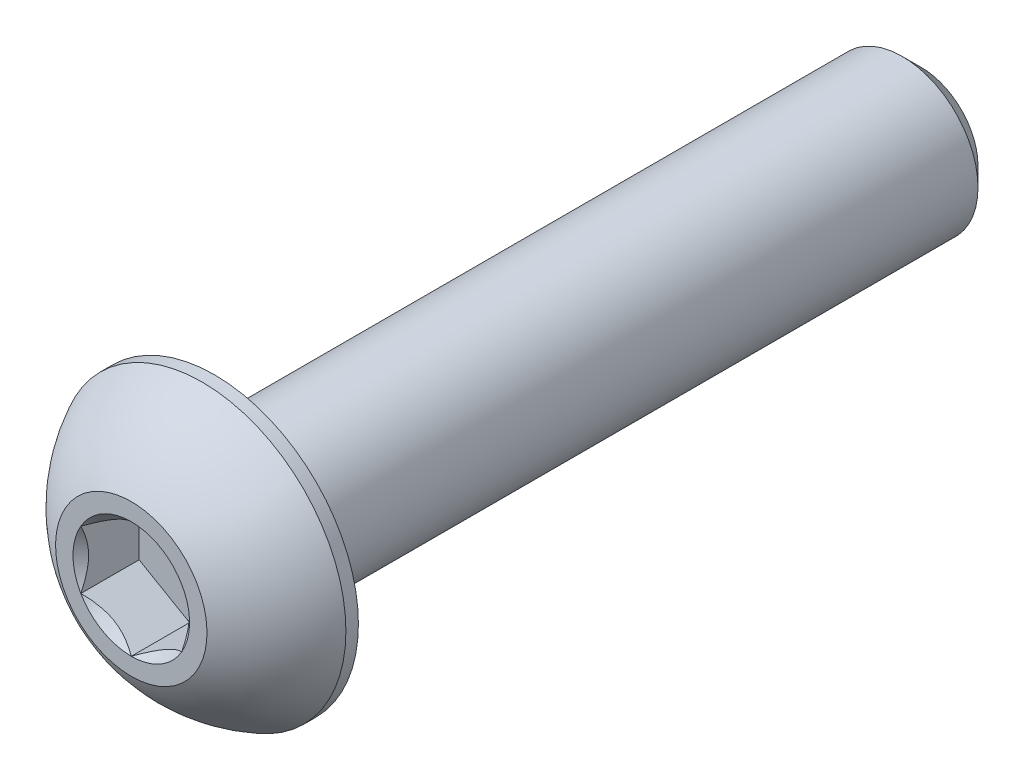
ISO-10303-21;
HEADER;
FILE_DESCRIPTION(('STEP AP214'),'2;1');
FILE_NAME('part.step','',(''),(''),'','','');
FILE_SCHEMA(('AUTOMOTIVE_DESIGN { 1 0 10303 214 1 1 1 1 }'));
ENDSEC;
DATA;
#1=APPLICATION_CONTEXT('core data for automotive mechanical design processes');
#2=APPLICATION_PROTOCOL_DEFINITION('international standard','automotive_design',2000,#1);
#3=PRODUCT_CONTEXT('',#1,'mechanical');
#4=PRODUCT('Part','Part','',(#3));
#5=PRODUCT_RELATED_PRODUCT_CATEGORY('part','',(#4));
#6=PRODUCT_DEFINITION_FORMATION('','',#4);
#7=PRODUCT_DEFINITION_CONTEXT('part definition',#1,'design');
#8=PRODUCT_DEFINITION('design','',#6,#7);
#9=PRODUCT_DEFINITION_SHAPE('','',#8);
#10=(LENGTH_UNIT() NAMED_UNIT(*) SI_UNIT(.MILLI.,.METRE.));
#11=(NAMED_UNIT(*) PLANE_ANGLE_UNIT() SI_UNIT($,.RADIAN.));
#12=(NAMED_UNIT(*) SI_UNIT($,.STERADIAN.) SOLID_ANGLE_UNIT());
#13=UNCERTAINTY_MEASURE_WITH_UNIT(LENGTH_MEASURE(1.E-05),#10,'distance_accuracy_value','');
#14=(GEOMETRIC_REPRESENTATION_CONTEXT(3) GLOBAL_UNCERTAINTY_ASSIGNED_CONTEXT((#13)) GLOBAL_UNIT_ASSIGNED_CONTEXT((#10,
#11,#12)) REPRESENTATION_CONTEXT('',''));
#15=CARTESIAN_POINT('',(0.,0.,0.));
#16=DIRECTION('',(0.,0.,1.));
#17=DIRECTION('',(1.,0.,0.));
#18=AXIS2_PLACEMENT_3D('',#15,#16,#17);
#19=CARTESIAN_POINT('',(0.,0.,-15.65));
#20=DIRECTION('',(0.,0.,1.));
#21=DIRECTION('',(1.,0.,0.));
#22=AXIS2_PLACEMENT_3D('',#19,#20,#21);
#23=PLANE('',#22);
#24=CARTESIAN_POINT('',(0.,0.,-15.65));
#25=DIRECTION('',(0.,0.,1.));
#26=DIRECTION('',(1.,0.,0.));
#27=AXIS2_PLACEMENT_3D('',#24,#25,#26);
#28=CIRCLE('',#27,1.12500000000003);
#29=CARTESIAN_POINT('',(1.12500000000003,0.,-15.65));
#30=VERTEX_POINT('',#29);
#31=EDGE_CURVE('E51',#30,#30,#28,.T.);
#32=ORIENTED_EDGE('',*,*,#31,.F.);
#33=EDGE_LOOP('',(#32));
#34=FACE_BOUND('',#33,.T.);
#35=ADVANCED_FACE('F38',(#34),#23,.F.);
#36=CARTESIAN_POINT('',(0.,0.,-15.65));
#37=DIRECTION('',(0.,0.,1.));
#38=DIRECTION('',(1.,0.,0.));
#39=AXIS2_PLACEMENT_3D('',#36,#37,#38);
#40=CONICAL_SURFACE('',#39,1.12500000000003,0.785398163397429);
#41=CARTESIAN_POINT('',(0.,0.,-15.275));
#42=DIRECTION('',(0.,0.,1.));
#43=DIRECTION('',(1.,0.,0.));
#44=AXIS2_PLACEMENT_3D('',#41,#42,#43);
#45=CIRCLE('',#44,1.50000000000002);
#46=CARTESIAN_POINT('',(1.50000000000002,0.,-15.275));
#47=VERTEX_POINT('',#46);
#48=EDGE_CURVE('E177',#47,#47,#45,.T.);
#49=ORIENTED_EDGE('',*,*,#48,.F.);
#50=EDGE_LOOP('',(#49));
#51=FACE_BOUND('',#50,.T.);
#52=ORIENTED_EDGE('',*,*,#31,.T.);
#53=EDGE_LOOP('',(#52));
#54=FACE_BOUND('',#53,.T.);
#55=ADVANCED_FACE('F182',(#51,#54),#40,.T.);
#56=CARTESIAN_POINT('',(0.,0.,0.));
#57=DIRECTION('',(0.,0.,1.));
#58=DIRECTION('',(1.,0.,0.));
#59=AXIS2_PLACEMENT_3D('',#56,#57,#58);
#60=CYLINDRICAL_SURFACE('',#59,1.50000000000002);
#61=CARTESIAN_POINT('',(0.,0.,-1.65));
#62=DIRECTION('',(0.,0.,1.));
#63=DIRECTION('',(1.,0.,0.));
#64=AXIS2_PLACEMENT_3D('',#61,#62,#63);
#65=CIRCLE('',#64,1.50000000000002);
#66=CARTESIAN_POINT('',(1.50000000000002,0.,-1.65));
#67=VERTEX_POINT('',#66);
#68=EDGE_CURVE('E174',#67,#67,#65,.T.);
#69=ORIENTED_EDGE('',*,*,#68,.F.);
#70=EDGE_LOOP('',(#69));
#71=FACE_BOUND('',#70,.T.);
#72=ORIENTED_EDGE('',*,*,#48,.T.);
#73=EDGE_LOOP('',(#72));
#74=FACE_BOUND('',#73,.T.);
#75=ADVANCED_FACE('F188',(#71,#74),#60,.T.);
#76=CARTESIAN_POINT('',(0.,-2.85,-1.65));
#77=DIRECTION('',(0.,0.,1.));
#78=DIRECTION('',(1.,0.,0.));
#79=AXIS2_PLACEMENT_3D('',#76,#77,#78);
#80=PLANE('',#79);
#81=CARTESIAN_POINT('',(0.,0.,-1.65));
#82=DIRECTION('',(0.,0.,1.));
#83=DIRECTION('',(1.,0.,0.));
#84=AXIS2_PLACEMENT_3D('',#81,#82,#83);
#85=CIRCLE('',#84,2.85);
#86=CARTESIAN_POINT('',(2.85,0.,-1.65));
#87=VERTEX_POINT('',#86);
#88=EDGE_CURVE('E168',#87,#87,#85,.T.);
#89=ORIENTED_EDGE('',*,*,#88,.F.);
#90=EDGE_LOOP('',(#89));
#91=FACE_BOUND('',#90,.T.);
#92=ORIENTED_EDGE('',*,*,#68,.T.);
#93=EDGE_LOOP('',(#92));
#94=FACE_BOUND('',#93,.T.);
#95=ADVANCED_FACE('F193',(#91,#94),#80,.F.);
#96=CARTESIAN_POINT('',(0.,0.,-2.79483288770053));
#97=DIRECTION('',(0.,0.,1.));
#98=DIRECTION('',(0.,-1.,0.));
#99=AXIS2_PLACEMENT_3D('',#96,#97,#98);
#100=SPHERICAL_SURFACE('',#99,3.17192226735975);
#101=CARTESIAN_POINT('',(0.,0.,0.));
#102=DIRECTION('',(0.,0.,1.));
#103=DIRECTION('',(1.,0.,0.));
#104=AXIS2_PLACEMENT_3D('',#101,#102,#103);
#105=CIRCLE('',#104,1.50000000000002);
#106=CARTESIAN_POINT('',(0.,-1.50000000000002,0.));
#107=VERTEX_POINT('',#106);
#108=EDGE_CURVE('E171',#107,#107,#105,.T.);
#109=CARTESIAN_POINT('',(0.,0.,-1.4025));
#110=DIRECTION('',(0.,0.,1.));
#111=DIRECTION('',(1.,0.,0.));
#112=AXIS2_PLACEMENT_3D('',#109,#110,#111);
#113=CIRCLE('',#112,2.85);
#114=CARTESIAN_POINT('',(0.,-2.85,-1.4025));
#115=VERTEX_POINT('',#114);
#116=EDGE_CURVE('E165',#115,#115,#113,.T.);
#117=CARTESIAN_POINT('',(0.,-1.50000000000002,0.));
#118=CARTESIAN_POINT('',(0.,-1.51816007989212,-0.009746569473365));
#119=CARTESIAN_POINT('',(0.,-1.53622513742982,-0.0196701847238474));
#120=CARTESIAN_POINT('',(0.,-1.57215840256596,-0.039867631129312));
#121=CARTESIAN_POINT('',(0.,-1.59002661016439,-0.0501414622842942));
#122=CARTESIAN_POINT('',(0.,-1.62555937019151,-0.0710354648490238));
#123=CARTESIAN_POINT('',(0.,-1.64322392262021,-0.0816556362587711));
#124=CARTESIAN_POINT('',(0.,-1.67834266450263,-0.103238276426968));
#125=CARTESIAN_POINT('',(0.,-1.69579685395637,-0.114200745185417));
#126=CARTESIAN_POINT('',(0.,-1.73048823664555,-0.136463816635607));
#127=CARTESIAN_POINT('',(0.,-1.747725429881,-0.147764419327348));
#128=CARTESIAN_POINT('',(0.,-1.78197627078177,-0.170699464187154));
#129=CARTESIAN_POINT('',(0.,-1.7989899184471,-0.18233390635522));
#130=CARTESIAN_POINT('',(0.,-1.83278720341136,-0.205932209546913));
#131=CARTESIAN_POINT('',(0.,-1.84957084071029,-0.217896070570541));
#132=CARTESIAN_POINT('',(0.,-1.88290172764637,-0.242148665498755));
#133=CARTESIAN_POINT('',(0.,-1.89944897728351,-0.254437399403342));
#134=CARTESIAN_POINT('',(0.,-1.9323008013937,-0.279335070725424));
#135=CARTESIAN_POINT('',(0.,-1.94860537586674,-0.291944008142921));
#136=CARTESIAN_POINT('',(0.,-1.98096565436366,-0.317477295441113));
#137=CARTESIAN_POINT('',(0.,-1.99702135838754,-0.330401645321808));
#138=CARTESIAN_POINT('',(0.,-2.02887779526297,-0.356560846652227));
#139=CARTESIAN_POINT('',(0.,-2.04467852811453,-0.36979569810195));
#140=CARTESIAN_POINT('',(0.,-2.07601901880465,-0.396570873693308));
#141=CARTESIAN_POINT('',(0.,-2.09155877664322,-0.410111197834944));
#142=CARTESIAN_POINT('',(0.,-2.12237141262986,-0.437492173862107));
#143=CARTESIAN_POINT('',(0.,-2.13764429077792,-0.451332825747635));
#144=CARTESIAN_POINT('',(0.,-2.16791736411296,-0.479309198198269));
#145=CARTESIAN_POINT('',(0.,-2.18291755929994,-0.493444918763376));
#146=CARTESIAN_POINT('',(0.,-2.21263956705415,-0.522006057390952));
#147=CARTESIAN_POINT('',(0.,-2.2273613796214,-0.53643147545342));
#148=CARTESIAN_POINT('',(0.,-2.25652102825521,-0.565566527816472));
#149=CARTESIAN_POINT('',(0.,-2.27095886432178,-0.580276162117056));
#150=CARTESIAN_POINT('',(0.,-2.2995450739765,-0.609974057702796));
#151=CARTESIAN_POINT('',(0.,-2.31369344756466,-0.624962318987953));
#152=CARTESIAN_POINT('',(0.,-2.34169535627252,-0.65521177341876));
#153=CARTESIAN_POINT('',(0.,-2.35554889139224,-0.670472966564411));
#154=CARTESIAN_POINT('',(0.,-2.38295585920366,-0.701262485885584));
#155=CARTESIAN_POINT('',(0.,-2.39650929189537,-0.716790812061106));
#156=CARTESIAN_POINT('',(0.,-2.42331090492182,-0.748108697108243));
#157=CARTESIAN_POINT('',(0.,-2.43655908525657,-0.763898255979859));
#158=CARTESIAN_POINT('',(0.,-2.46274515962755,-0.795732606824228));
#159=CARTESIAN_POINT('',(0.,-2.47568305366379,-0.811777398796981));
#160=CARTESIAN_POINT('',(0.,-2.50124363939651,-0.844116119267127));
#161=CARTESIAN_POINT('',(0.,-2.51386633109298,-0.86041004776452));
#162=CARTESIAN_POINT('',(0.,-2.53879171587279,-0.8932408500426));
#163=CARTESIAN_POINT('',(0.,-2.55109440895612,-0.909777723823287));
#164=CARTESIAN_POINT('',(0.,-2.57537512182785,-0.94308813311364));
#165=CARTESIAN_POINT('',(0.,-2.58735314161625,-0.959861668623306));
#166=CARTESIAN_POINT('',(0.,-2.61097995657956,-0.993639027894247));
#167=CARTESIAN_POINT('',(0.,-2.62262875175448,-1.01064285165552));
#168=CARTESIAN_POINT('',(0.,-2.64559269128199,-1.04487432644225));
#169=CARTESIAN_POINT('',(0.,-2.65690783563458,-1.06210197746771));
#170=CARTESIAN_POINT('',(0.,-2.67920017403639,-1.09677456077299));
#171=CARTESIAN_POINT('',(0.,-2.69017736808561,-1.11421949305282));
#172=CARTESIAN_POINT('',(0.,-2.711789634999,-1.14932001019995));
#173=CARTESIAN_POINT('',(0.,-2.72242470786316,-1.16697559506725));
#174=CARTESIAN_POINT('',(0.,-2.74334869082118,-1.20249070903943));
#175=CARTESIAN_POINT('',(0.,-2.75363760091502,-1.22035023814429));
#176=CARTESIAN_POINT('',(0.,-2.77386535089241,-1.25626645340824));
#177=CARTESIAN_POINT('',(0.,-2.78380419077596,-1.27432313956732));
#178=CARTESIAN_POINT('',(0.,-2.80332801615778,-1.31062681184411));
#179=CARTESIAN_POINT('',(0.,-2.81291300165605,-1.32887379796182));
#180=CARTESIAN_POINT('',(0.,-2.83172550494215,-1.3655511220839));
#181=CARTESIAN_POINT('',(0.,-2.84095302272998,-1.38398146008827));
#182=CARTESIAN_POINT('',(0.,-2.85,-1.4025));
#183=B_SPLINE_CURVE_WITH_KNOTS('',3,(#117,#118,#119,#120,#121,#122,#123,#124,#125,#126,#127,
#128,#129,#130,#131,#132,#133,#134,#135,#136,#137,#138,#139,#140,#141,#142,#143,#144,#145,#146,
#147,#148,#149,#150,#151,#152,#153,#154,#155,#156,#157,#158,#159,#160,#161,#162,#163,#164,#165,
#166,#167,#168,#169,#170,#171,#172,#173,#174,#175,#176,#177,#178,#179,#180,#181,#182),
.UNSPECIFIED.,.F.,.F.,(4,2,2,2,2,2,2,2,2,2,2,2,2,2,2,2,2,2,2,2,2,2,2,2,2,2,2,2,2,2,2,2,4),(0.,
0.061829894182698,0.123659788365395,0.185489682548094,0.247319576730792,0.30914947091349,
0.370979365096188,0.432809259278885,0.494639153461583,0.556469047644282,0.618298941826979,
0.680128836009677,0.741958730192375,0.803788624375073,0.865618518557771,0.927448412740469,
0.989278306923166,1.05110820110586,1.11293809528856,1.17476798947126,1.23659788365396,
1.29842777783666,1.36025767201935,1.42208756620205,1.48391746038475,1.54574735456745,
1.60757724875015,1.66940714293284,1.73123703711554,1.79306693129824,1.85489682548094,
1.91672671966364,1.97855661384633),.UNSPECIFIED.);
#184=EDGE_CURVE('BSEAM198',#107,#115,#183,.T.);
#185=ORIENTED_EDGE('',*,*,#108,.F.);
#186=ORIENTED_EDGE('',*,*,#116,.T.);
#187=ORIENTED_EDGE('',*,*,#184,.T.);
#188=ORIENTED_EDGE('',*,*,#184,.F.);
#189=EDGE_LOOP('',(#185,#187,#186,#188));
#190=FACE_BOUND('',#189,.T.);
#191=ADVANCED_FACE('F198',(#190),#100,.T.);
#192=CARTESIAN_POINT('',(0.,-1.50000000000002,0.));
#193=DIRECTION('',(0.,0.,-1.));
#194=DIRECTION('',(-1.,0.,0.));
#195=AXIS2_PLACEMENT_3D('',#192,#193,#194);
#196=PLANE('',#195);
#197=CARTESIAN_POINT('',(0.,0.,0.));
#198=DIRECTION('',(0.,0.,1.));
#199=DIRECTION('',(1.,0.,0.));
#200=AXIS2_PLACEMENT_3D('',#197,#198,#199);
#201=CIRCLE('',#200,1.15470053837925);
#202=CARTESIAN_POINT('',(-0.999999999999997,0.577350269189625,0.));
#203=VERTEX_POINT('',#202);
#204=CARTESIAN_POINT('',(-0.999999999999997,-0.577350269189627,0.));
#205=VERTEX_POINT('',#204);
#206=EDGE_CURVE('E64',#203,#205,#201,.T.);
#207=ORIENTED_EDGE('',*,*,#206,.F.);
#208=CARTESIAN_POINT('',(0.,1.15470053837925,0.));
#209=VERTEX_POINT('',#208);
#210=EDGE_CURVE('E136',#209,#203,#201,.T.);
#211=ORIENTED_EDGE('',*,*,#210,.F.);
#212=CARTESIAN_POINT('',(1.,0.57735026918962,0.));
#213=VERTEX_POINT('',#212);
#214=EDGE_CURVE('E133',#213,#209,#201,.T.);
#215=ORIENTED_EDGE('',*,*,#214,.F.);
#216=CARTESIAN_POINT('',(1.,-0.577350269189621,0.));
#217=VERTEX_POINT('',#216);
#218=EDGE_CURVE('E104',#217,#213,#201,.T.);
#219=ORIENTED_EDGE('',*,*,#218,.F.);
#220=CARTESIAN_POINT('',(0.,-1.15470053837925,0.));
#221=VERTEX_POINT('',#220);
#222=EDGE_CURVE('E96',#221,#217,#201,.T.);
#223=ORIENTED_EDGE('',*,*,#222,.F.);
#224=EDGE_CURVE('E57',#205,#221,#201,.T.);
#225=ORIENTED_EDGE('',*,*,#224,.F.);
#226=EDGE_LOOP('',(#207,#211,#215,#219,#223,#225));
#227=FACE_BOUND('',#226,.T.);
#228=ORIENTED_EDGE('',*,*,#108,.T.);
#229=EDGE_LOOP('',(#228));
#230=FACE_BOUND('',#229,.T.);
#231=ADVANCED_FACE('F130',(#227,#230),#196,.F.);
#232=CARTESIAN_POINT('',(0.,0.,0.));
#233=DIRECTION('',(0.,0.,1.));
#234=DIRECTION('',(1.,0.,0.));
#235=AXIS2_PLACEMENT_3D('',#232,#233,#234);
#236=CYLINDRICAL_SURFACE('',#235,2.85);
#237=ORIENTED_EDGE('',*,*,#116,.F.);
#238=EDGE_LOOP('',(#237));
#239=FACE_BOUND('',#238,.T.);
#240=ORIENTED_EDGE('',*,*,#88,.T.);
#241=EDGE_LOOP('',(#240));
#242=FACE_BOUND('',#241,.T.);
#243=ADVANCED_FACE('F204',(#239,#242),#236,.T.);
#244=CARTESIAN_POINT('',(0.,0.,0.));
#245=DIRECTION('',(0.,0.,1.));
#246=DIRECTION('',(1.,0.,0.));
#247=AXIS2_PLACEMENT_3D('',#244,#245,#246);
#248=CONICAL_SURFACE('',#247,1.15470053837925,0.78539816339745);
#249=ORIENTED_EDGE('',*,*,#218,.T.);
#250=CARTESIAN_POINT('',(1.,-1.15147208646461,0.370385677513857));
#251=CARTESIAN_POINT('',(1.,-1.12343447988551,0.349219919873708));
#252=CARTESIAN_POINT('',(1.,-1.09524064850696,0.328261692175906));
#253=CARTESIAN_POINT('',(1.,-1.03847715644375,0.286846022235618));
#254=CARTESIAN_POINT('',(1.,-1.00990740382974,0.266388706123655));
#255=CARTESIAN_POINT('',(1.,-0.92312089433347,0.205604794954506));
#256=CARTESIAN_POINT('',(1.,-0.864253173759053,0.166192228961395));
#257=CARTESIAN_POINT('',(1.,-0.74080985825804,0.0888206642002037));
#258=CARTESIAN_POINT('',(1.,-0.676100255137802,0.0510730391143415));
#259=CARTESIAN_POINT('',(1.,-0.54344893904912,-0.0179754124487081));
#260=CARTESIAN_POINT('',(1.,-0.475519112027775,-0.049297972153134));
#261=CARTESIAN_POINT('',(1.,-0.373555850333526,-0.0876182211162039));
#262=CARTESIAN_POINT('',(1.,-0.341031989670905,-0.0986164083578424));
#263=CARTESIAN_POINT('',(1.,-0.275199079052291,-0.118001657852638));
#264=CARTESIAN_POINT('',(1.,-0.24188997517393,-0.126388540223299));
#265=CARTESIAN_POINT('',(1.,-0.17524751704299,-0.139974779280982));
#266=CARTESIAN_POINT('',(1.,-0.141925568218173,-0.145229209232031));
#267=CARTESIAN_POINT('',(1.,-0.0749144362322771,-0.152451313429106));
#268=CARTESIAN_POINT('',(1.,-0.0412251978501601,-0.15441848638949));
#269=CARTESIAN_POINT('',(1.,0.0249580992634224,-0.154916801606837));
#270=CARTESIAN_POINT('',(1.,0.0574512826460405,-0.153569732111363));
#271=CARTESIAN_POINT('',(1.,0.122148505701868,-0.147783515501013));
#272=CARTESIAN_POINT('',(1.,0.154352610132927,-0.143345079338462));
#273=CARTESIAN_POINT('',(1.,0.21879989886764,-0.131543169854794));
#274=CARTESIAN_POINT('',(1.,0.251033743268954,-0.124129458961488));
#275=CARTESIAN_POINT('',(1.,0.314797132354919,-0.106771057501322));
#276=CARTESIAN_POINT('',(1.,0.346326735731005,-0.0968265787111677));
#277=CARTESIAN_POINT('',(1.,0.445594187730205,-0.0617765174456608));
#278=CARTESIAN_POINT('',(1.,0.511919139476036,-0.0326791416432731));
#279=CARTESIAN_POINT('',(1.,0.641453244657532,0.0320153296865072));
#280=CARTESIAN_POINT('',(1.,0.704650133126345,0.0676357767152442));
#281=CARTESIAN_POINT('',(1.,0.825428490174987,0.141123901346938));
#282=CARTESIAN_POINT('',(1.,0.883132947867685,0.178791947135466));
#283=CARTESIAN_POINT('',(1.,0.968148853704565,0.237022852943166));
#284=CARTESIAN_POINT('',(1.,0.996120570380285,0.256638475762859));
#285=CARTESIAN_POINT('',(1.,1.05168177729901,0.296388517061273));
#286=CARTESIAN_POINT('',(1.,1.079271369977,0.316522792198834));
#287=CARTESIAN_POINT('',(1.,1.10670185346329,0.336872119072974));
#288=B_SPLINE_CURVE_WITH_KNOTS('',3,(#250,#251,#252,#253,#254,#255,#256,#257,#258,#259,#260,
#261,#262,#263,#264,#265,#266,#267,#268,#269,#270,#271,#272,#273,#274,#275,#276,#277,#278,#279,
#280,#281,#282,#283,#284,#285,#286,#287),.UNSPECIFIED.,.F.,.F.,(4,2,2,2,2,2,2,2,2,2,2,2,2,2,2,2,
2,2,4),(0.,0.10538645908329,0.210799187330123,0.423233611565466,0.647793540908498,
0.871580877738603,0.974493074181413,1.077412358272,1.17846428203204,1.27953161415761,
1.37694086739609,1.47432772585407,1.57343322804292,1.6725304397285,1.88917353996826,
2.10660791038812,2.31323734249842,2.41572589232043,2.51818641476502),.UNSPECIFIED.);
#289=EDGE_CURVE('E11',#217,#213,#288,.T.);
#290=ORIENTED_EDGE('',*,*,#289,.F.);
#291=EDGE_LOOP('',(#249,#290));
#292=FACE_BOUND('',#291,.T.);
#293=ADVANCED_FACE('F108',(#292),#248,.F.);
#294=ORIENTED_EDGE('',*,*,#214,.T.);
#295=CARTESIAN_POINT('',(1.0002,0.577234799135786,0.000115487372616175));
#296=CARTESIAN_POINT('',(0.96581740499282,0.59708559961862,-0.0197220691742649));
#297=CARTESIAN_POINT('',(0.930859881860175,0.617268335009455,-0.0383949793611092));
#298=CARTESIAN_POINT('',(0.85957719704391,0.658423412276684,-0.0725852572768405));
#299=CARTESIAN_POINT('',(0.823245249471016,0.679399671988078,-0.0880835909765399));
#300=CARTESIAN_POINT('',(0.749983386196688,0.721697428470845,-0.114632692857734));
#301=CARTESIAN_POINT('',(0.713072148554585,0.743008141459635,-0.125750226003073));
#302=CARTESIAN_POINT('',(0.63843727068914,0.786098608286185,-0.142880134223817));
#303=CARTESIAN_POINT('',(0.600715911891363,0.80787704494228,-0.148905302533326));
#304=CARTESIAN_POINT('',(0.535707801582065,0.845409494928862,-0.154339445032505));
#305=CARTESIAN_POINT('',(0.508505628471827,0.8611146768966,-0.155143061683267));
#306=CARTESIAN_POINT('',(0.454153959330887,0.892494627706028,-0.153793300583112));
#307=CARTESIAN_POINT('',(0.427004476245123,0.908169389073952,-0.1516392704528));
#308=CARTESIAN_POINT('',(0.345943722673039,0.954969836969509,-0.140883027871528));
#309=CARTESIAN_POINT('',(0.292435859021572,0.985862616452446,-0.127985443584643));
#310=CARTESIAN_POINT('',(0.198523934856568,1.04008269114923,-0.0968592693978221));
#311=CARTESIAN_POINT('',(0.157679476328165,1.0636642502755,-0.0802622022981601));
#312=CARTESIAN_POINT('',(0.0775903626180563,1.10990372163519,-0.042875075314707));
#313=CARTESIAN_POINT('',(0.0383409891295625,1.1325643579843,-0.0220986581825966));
#314=CARTESIAN_POINT('',(-0.000199999999999514,1.15481600843309,0.000115487372613833));
#315=B_SPLINE_CURVE_WITH_KNOTS('',3,(#295,#296,#297,#298,#299,#300,#301,#302,#303,#304,#305,
#306,#307,#308,#309,#310,#311,#312,#313,#314),.UNSPECIFIED.,.F.,.F.,(4,2,2,2,2,2,2,2,2,4),(0.,
0.13323767682856,0.267252229834491,0.399137076269302,0.53068960328077,0.624814864263848,
0.718960890149135,0.907306626112099,1.05710100361789,1.20641411519286),.UNSPECIFIED.);
#316=EDGE_CURVE('E135',#213,#209,#315,.T.);
#317=ORIENTED_EDGE('',*,*,#316,.F.);
#318=EDGE_LOOP('',(#294,#317));
#319=FACE_BOUND('',#318,.T.);
#320=ADVANCED_FACE('F291',(#319),#248,.F.);
#321=ORIENTED_EDGE('',*,*,#210,.T.);
#322=CARTESIAN_POINT('',(0.000200000000000433,1.15481600843309,0.000115487372613877));
#323=CARTESIAN_POINT('',(-0.0341825950071802,1.13496520795025,-0.019722069174267));
#324=CARTESIAN_POINT('',(-0.0691401181398243,1.11478247255942,-0.0383949793611112));
#325=CARTESIAN_POINT('',(-0.140422802956089,1.07362739529219,-0.0725852572768422));
#326=CARTESIAN_POINT('',(-0.176754750528983,1.0526511355808,-0.0880835909765415));
#327=CARTESIAN_POINT('',(-0.25001661380331,1.01035337909803,-0.114632692857735));
#328=CARTESIAN_POINT('',(-0.286927851445413,0.989042666109238,-0.125750226003074));
#329=CARTESIAN_POINT('',(-0.361562729310858,0.945952199282689,-0.142880134223818));
#330=CARTESIAN_POINT('',(-0.399284088108635,0.924173762626594,-0.148905302533327));
#331=CARTESIAN_POINT('',(-0.464292198417932,0.886641312640012,-0.154339445032506));
#332=CARTESIAN_POINT('',(-0.491494371528171,0.870936130672273,-0.155143061683268));
#333=CARTESIAN_POINT('',(-0.54584604066911,0.839556179862846,-0.153793300583113));
#334=CARTESIAN_POINT('',(-0.572995523754874,0.823881418494921,-0.151639270452801));
#335=CARTESIAN_POINT('',(-0.654056277326958,0.777080970599365,-0.140883027871529));
#336=CARTESIAN_POINT('',(-0.707564140978425,0.746188191116428,-0.127985443584644));
#337=CARTESIAN_POINT('',(-0.801476065143429,0.691968116419648,-0.096859269397823));
#338=CARTESIAN_POINT('',(-0.842320523671832,0.66838655729337,-0.080262202298161));
#339=CARTESIAN_POINT('',(-0.922409637381941,0.62214708593368,-0.0428750753147078));
#340=CARTESIAN_POINT('',(-0.961659010870435,0.599486449584574,-0.0220986581825973));
#341=CARTESIAN_POINT('',(-1.0002,0.577234799135787,0.00011548737261326));
#342=B_SPLINE_CURVE_WITH_KNOTS('',3,(#322,#323,#324,#325,#326,#327,#328,#329,#330,#331,#332,
#333,#334,#335,#336,#337,#338,#339,#340,#341),.UNSPECIFIED.,.F.,.F.,(4,2,2,2,2,2,2,2,2,4),(0.,
0.133237676828559,0.26725222983449,0.399137076269299,0.530689603280767,0.624814864263845,
0.718960890149132,0.907306626112096,1.05710100361789,1.20641411519286),.UNSPECIFIED.);
#343=EDGE_CURVE('E140',#209,#203,#342,.T.);
#344=ORIENTED_EDGE('',*,*,#343,.F.);
#345=EDGE_LOOP('',(#321,#344));
#346=FACE_BOUND('',#345,.T.);
#347=ADVANCED_FACE('F143',(#346),#248,.F.);
#348=ORIENTED_EDGE('',*,*,#206,.T.);
#349=CARTESIAN_POINT('',(-0.999999999999996,-1.15147208646461,0.370385677513859));
#350=CARTESIAN_POINT('',(-0.999999999999996,-1.12343447988552,0.34921991987371));
#351=CARTESIAN_POINT('',(-0.999999999999996,-1.09524064850697,0.328261692175907));
#352=CARTESIAN_POINT('',(-0.999999999999996,-1.03847715644376,0.286846022235619));
#353=CARTESIAN_POINT('',(-0.999999999999996,-1.00990740382975,0.266388706123656));
#354=CARTESIAN_POINT('',(-0.999999999999996,-0.923120894333474,0.205604794954507));
#355=CARTESIAN_POINT('',(-0.999999999999997,-0.864253173759057,0.166192228961396));
#356=CARTESIAN_POINT('',(-0.999999999999997,-0.740809858258044,0.0888206642002033));
#357=CARTESIAN_POINT('',(-0.999999999999997,-0.676100255137805,0.0510730391143406));
#358=CARTESIAN_POINT('',(-0.999999999999997,-0.543448939049123,-0.0179754124487097));
#359=CARTESIAN_POINT('',(-0.999999999999997,-0.475519112027777,-0.049297972153136));
#360=CARTESIAN_POINT('',(-0.999999999999997,-0.373555850333528,-0.0876182211162064));
#361=CARTESIAN_POINT('',(-0.999999999999997,-0.341031989670907,-0.098616408357845));
#362=CARTESIAN_POINT('',(-0.999999999999997,-0.275199079052293,-0.118001657852641));
#363=CARTESIAN_POINT('',(-0.999999999999997,-0.241889975173932,-0.126388540223302));
#364=CARTESIAN_POINT('',(-0.999999999999997,-0.175247517042992,-0.139974779280985));
#365=CARTESIAN_POINT('',(-0.999999999999997,-0.141925568218175,-0.145229209232034));
#366=CARTESIAN_POINT('',(-0.999999999999997,-0.0749144362322791,-0.152451313429109));
#367=CARTESIAN_POINT('',(-0.999999999999997,-0.041225197850162,-0.154418486389493));
#368=CARTESIAN_POINT('',(-0.999999999999997,0.0249580992634205,-0.15491680160684));
#369=CARTESIAN_POINT('',(-0.999999999999997,0.0574512826460387,-0.153569732111367));
#370=CARTESIAN_POINT('',(-0.999999999999997,0.122148505701866,-0.147783515501016));
#371=CARTESIAN_POINT('',(-0.999999999999997,0.154352610132926,-0.143345079338466));
#372=CARTESIAN_POINT('',(-0.999999999999997,0.218799898867639,-0.131543169854798));
#373=CARTESIAN_POINT('',(-0.999999999999997,0.251033743268952,-0.124129458961492));
#374=CARTESIAN_POINT('',(-0.999999999999997,0.314797132354917,-0.106771057501326));
#375=CARTESIAN_POINT('',(-0.999999999999997,0.346326735731003,-0.0968265787111716));
#376=CARTESIAN_POINT('',(-0.999999999999997,0.445594187730203,-0.0617765174456648));
#377=CARTESIAN_POINT('',(-0.999999999999997,0.511919139476034,-0.0326791416432772));
#378=CARTESIAN_POINT('',(-0.999999999999997,0.641453244657529,0.0320153296865026));
#379=CARTESIAN_POINT('',(-0.999999999999997,0.704650133126341,0.0676357767152392));
#380=CARTESIAN_POINT('',(-0.999999999999997,0.825428490174983,0.141123901346932));
#381=CARTESIAN_POINT('',(-0.999999999999997,0.883132947867681,0.17879194713546));
#382=CARTESIAN_POINT('',(-0.999999999999997,0.968148853704561,0.23702285294316));
#383=CARTESIAN_POINT('',(-0.999999999999997,0.99612057038028,0.256638475762853));
#384=CARTESIAN_POINT('',(-0.999999999999997,1.05168177729901,0.296388517061267));
#385=CARTESIAN_POINT('',(-0.999999999999997,1.079271369977,0.316522792198828));
#386=CARTESIAN_POINT('',(-0.999999999999997,1.10670185346329,0.336872119072968));
#387=B_SPLINE_CURVE_WITH_KNOTS('',3,(#349,#350,#351,#352,#353,#354,#355,#356,#357,#358,#359,
#360,#361,#362,#363,#364,#365,#366,#367,#368,#369,#370,#371,#372,#373,#374,#375,#376,#377,#378,
#379,#380,#381,#382,#383,#384,#385,#386),.UNSPECIFIED.,.F.,.F.,(4,2,2,2,2,2,2,2,2,2,2,2,2,2,2,2,
2,2,4),(0.,0.10538645908329,0.210799187330124,0.423233611565468,0.647793540908502,
0.871580877738608,0.974493074181418,1.07741235827201,1.17846428203204,1.27953161415762,
1.3769408673961,1.47432772585407,1.57343322804293,1.67253043972851,1.88917353996827,
2.10660791038812,2.31323734249843,2.41572589232044,2.51818641476502),.UNSPECIFIED.);
#388=EDGE_CURVE('E147',#203,#205,#387,.F.);
#389=ORIENTED_EDGE('',*,*,#388,.F.);
#390=EDGE_LOOP('',(#348,#389));
#391=FACE_BOUND('',#390,.T.);
#392=ADVANCED_FACE('F285',(#391),#248,.F.);
#393=ORIENTED_EDGE('',*,*,#224,.T.);
#394=CARTESIAN_POINT('',(-1.0002,-0.577234799135786,0.000115487372612706));
#395=CARTESIAN_POINT('',(-0.965817404992816,-0.59708559961862,-0.0197220691742684));
#396=CARTESIAN_POINT('',(-0.930859881860172,-0.617268335009454,-0.0383949793611125));
#397=CARTESIAN_POINT('',(-0.859577197043907,-0.658423412276684,-0.0725852572768433));
#398=CARTESIAN_POINT('',(-0.823245249471013,-0.679399671988078,-0.0880835909765424));
#399=CARTESIAN_POINT('',(-0.749983386196686,-0.721697428470844,-0.114632692857736));
#400=CARTESIAN_POINT('',(-0.713072148554583,-0.743008141459635,-0.125750226003075));
#401=CARTESIAN_POINT('',(-0.638437270689138,-0.786098608286184,-0.142880134223819));
#402=CARTESIAN_POINT('',(-0.600715911891361,-0.807877044942279,-0.148905302533328));
#403=CARTESIAN_POINT('',(-0.535707801582064,-0.84540949492886,-0.154339445032507));
#404=CARTESIAN_POINT('',(-0.508505628471825,-0.861114676896599,-0.155143061683269));
#405=CARTESIAN_POINT('',(-0.454153959330885,-0.892494627706026,-0.153793300583114));
#406=CARTESIAN_POINT('',(-0.427004476245122,-0.908169389073951,-0.151639270452802));
#407=CARTESIAN_POINT('',(-0.345943722673037,-0.954969836969508,-0.14088302787153));
#408=CARTESIAN_POINT('',(-0.29243585902157,-0.985862616452444,-0.127985443584645));
#409=CARTESIAN_POINT('',(-0.198523934856567,-1.04008269114922,-0.0968592693978238));
#410=CARTESIAN_POINT('',(-0.157679476328164,-1.0636642502755,-0.0802622022981617));
#411=CARTESIAN_POINT('',(-0.0775903626180547,-1.10990372163519,-0.0428750753147082));
#412=CARTESIAN_POINT('',(-0.0383409891295607,-1.1325643579843,-0.0220986581825977));
#413=CARTESIAN_POINT('',(0.000200000000001427,-1.15481600843309,0.000115487372612954));
#414=B_SPLINE_CURVE_WITH_KNOTS('',3,(#394,#395,#396,#397,#398,#399,#400,#401,#402,#403,#404,
#405,#406,#407,#408,#409,#410,#411,#412,#413),.UNSPECIFIED.,.F.,.F.,(4,2,2,2,2,2,2,2,2,4),(0.,
0.133237676828559,0.26725222983449,0.399137076269299,0.530689603280767,0.624814864263845,
0.718960890149132,0.907306626112096,1.05710100361789,1.20641411519286),.UNSPECIFIED.);
#415=EDGE_CURVE('E120',#205,#221,#414,.T.);
#416=ORIENTED_EDGE('',*,*,#415,.F.);
#417=EDGE_LOOP('',(#393,#416));
#418=FACE_BOUND('',#417,.T.);
#419=ADVANCED_FACE('F233',(#418),#248,.F.);
#420=ORIENTED_EDGE('',*,*,#222,.T.);
#421=CARTESIAN_POINT('',(-0.000199999999998591,-1.15481600843309,0.00011548737261301));
#422=CARTESIAN_POINT('',(0.0341825950071819,-1.13496520795025,-0.0197220691742678));
#423=CARTESIAN_POINT('',(0.0691401181398259,-1.11478247255942,-0.0383949793611118));
#424=CARTESIAN_POINT('',(0.14042280295609,-1.07362739529219,-0.0725852572768426));
#425=CARTESIAN_POINT('',(0.176754750528985,-1.05265113558079,-0.0880835909765418));
#426=CARTESIAN_POINT('',(0.250016613803312,-1.01035337909803,-0.114632692857735));
#427=CARTESIAN_POINT('',(0.286927851445415,-0.989042666109238,-0.125750226003074));
#428=CARTESIAN_POINT('',(0.361562729310859,-0.945952199282688,-0.142880134223818));
#429=CARTESIAN_POINT('',(0.399284088108636,-0.924173762626594,-0.148905302533327));
#430=CARTESIAN_POINT('',(0.464292198417933,-0.886641312640012,-0.154339445032506));
#431=CARTESIAN_POINT('',(0.491494371528172,-0.870936130672273,-0.155143061683268));
#432=CARTESIAN_POINT('',(0.545846040669111,-0.839556179862846,-0.153793300583113));
#433=CARTESIAN_POINT('',(0.572995523754875,-0.823881418494921,-0.151639270452801));
#434=CARTESIAN_POINT('',(0.654056277326959,-0.777080970599364,-0.140883027871529));
#435=CARTESIAN_POINT('',(0.707564140978426,-0.746188191116428,-0.127985443584645));
#436=CARTESIAN_POINT('',(0.801476065143431,-0.691968116419647,-0.0968592693978229));
#437=CARTESIAN_POINT('',(0.842320523671833,-0.668386557293369,-0.0802622022981606));
#438=CARTESIAN_POINT('',(0.922409637381943,-0.622147085933678,-0.0428750753147068));
#439=CARTESIAN_POINT('',(0.961659010870437,-0.599486449584572,-0.022098658182596));
#440=CARTESIAN_POINT('',(1.0002,-0.577234799135784,0.00011548737261471));
#441=B_SPLINE_CURVE_WITH_KNOTS('',3,(#421,#422,#423,#424,#425,#426,#427,#428,#429,#430,#431,
#432,#433,#434,#435,#436,#437,#438,#439,#440),.UNSPECIFIED.,.F.,.F.,(4,2,2,2,2,2,2,2,2,4),(0.,
0.133237676828559,0.267252229834489,0.399137076269299,0.530689603280766,0.624814864263844,
0.71896089014913,0.907306626112094,1.05710100361789,1.20641411519286),.UNSPECIFIED.);
#442=EDGE_CURVE('E100',#221,#217,#441,.T.);
#443=ORIENTED_EDGE('',*,*,#442,.F.);
#444=EDGE_LOOP('',(#420,#443));
#445=FACE_BOUND('',#444,.T.);
#446=ADVANCED_FACE('F98',(#445),#248,.F.);
#447=CARTESIAN_POINT('',(1.,-0.577350269189622,-1.155));
#448=DIRECTION('',(0.,0.,1.));
#449=DIRECTION('',(1.,0.,0.));
#450=AXIS2_PLACEMENT_3D('',#447,#448,#449);
#451=PLANE('',#450);
#452=DIRECTION('',(0.866025403784438,0.5,0.));
#453=VECTOR('',#452,1.);
#454=CARTESIAN_POINT('',(0.,-1.15470053837925,-1.155));
#455=LINE('',#454,#453);
#456=CARTESIAN_POINT('',(0.,-1.15470053837925,-1.155));
#457=VERTEX_POINT('',#456);
#458=CARTESIAN_POINT('',(1.,-0.577350269189622,-1.155));
#459=VERTEX_POINT('',#458);
#460=EDGE_CURVE('E119',#457,#459,#455,.T.);
#461=ORIENTED_EDGE('',*,*,#460,.T.);
#462=DIRECTION('',(0.,1.,0.));
#463=VECTOR('',#462,1.);
#464=CARTESIAN_POINT('',(1.,-0.577350269189622,-1.155));
#465=LINE('',#464,#463);
#466=CARTESIAN_POINT('',(1.,0.577350269189624,-1.155));
#467=VERTEX_POINT('',#466);
#468=EDGE_CURVE('E124',#459,#467,#465,.T.);
#469=ORIENTED_EDGE('',*,*,#468,.T.);
#470=DIRECTION('',(-0.866025403784439,0.499999999999999,0.));
#471=VECTOR('',#470,1.);
#472=CARTESIAN_POINT('',(1.,0.577350269189624,-1.155));
#473=LINE('',#472,#471);
#474=CARTESIAN_POINT('',(0.,1.15470053837925,-1.155));
#475=VERTEX_POINT('',#474);
#476=EDGE_CURVE('E275',#467,#475,#473,.T.);
#477=ORIENTED_EDGE('',*,*,#476,.T.);
#478=DIRECTION('',(-0.866025403784439,-0.5,0.));
#479=VECTOR('',#478,1.);
#480=CARTESIAN_POINT('',(0.,1.15470053837925,-1.155));
#481=LINE('',#480,#479);
#482=CARTESIAN_POINT('',(-0.999999999999997,0.577350269189625,-1.155));
#483=VERTEX_POINT('',#482);
#484=EDGE_CURVE('E156',#475,#483,#481,.T.);
#485=ORIENTED_EDGE('',*,*,#484,.T.);
#486=DIRECTION('',(0.,-1.,0.));
#487=VECTOR('',#486,1.);
#488=CARTESIAN_POINT('',(-0.999999999999997,0.577350269189625,-1.155));
#489=LINE('',#488,#487);
#490=CARTESIAN_POINT('',(-0.999999999999997,-0.577350269189624,-1.155));
#491=VERTEX_POINT('',#490);
#492=EDGE_CURVE('E279',#483,#491,#489,.T.);
#493=ORIENTED_EDGE('',*,*,#492,.T.);
#494=DIRECTION('',(0.866025403784439,-0.5,0.));
#495=VECTOR('',#494,1.);
#496=CARTESIAN_POINT('',(-0.999999999999997,-0.577350269189624,-1.155));
#497=LINE('',#496,#495);
#498=EDGE_CURVE('E127',#491,#457,#497,.T.);
#499=ORIENTED_EDGE('',*,*,#498,.T.);
#500=EDGE_LOOP('',(#461,#469,#477,#485,#493,#499));
#501=FACE_BOUND('',#500,.T.);
#502=ADVANCED_FACE('F232',(#501),#451,.T.);
#503=CARTESIAN_POINT('',(1.,-0.577350269189622,-1.155));
#504=DIRECTION('',(1.,0.,0.));
#505=DIRECTION('',(0.,1.,0.));
#506=AXIS2_PLACEMENT_3D('',#503,#504,#505);
#507=PLANE('',#506);
#508=DIRECTION('',(0.,0.,1.));
#509=VECTOR('',#508,1.);
#510=CARTESIAN_POINT('',(1.,-0.577350269189622,-1.155));
#511=LINE('',#510,#509);
#512=EDGE_CURVE('E116',#459,#217,#511,.T.);
#513=ORIENTED_EDGE('',*,*,#512,.T.);
#514=ORIENTED_EDGE('',*,*,#289,.T.);
#515=DIRECTION('',(0.,0.,1.));
#516=VECTOR('',#515,1.);
#517=CARTESIAN_POINT('',(1.,0.577350269189624,-1.155));
#518=LINE('',#517,#516);
#519=EDGE_CURVE('E126',#467,#213,#518,.T.);
#520=ORIENTED_EDGE('',*,*,#519,.F.);
#521=ORIENTED_EDGE('',*,*,#468,.F.);
#522=EDGE_LOOP('',(#513,#514,#520,#521));
#523=FACE_BOUND('',#522,.T.);
#524=ADVANCED_FACE('F122',(#523),#507,.F.);
#525=CARTESIAN_POINT('',(1.,0.577350269189624,-1.155));
#526=DIRECTION('',(0.499999999999999,0.866025403784439,0.));
#527=DIRECTION('',(-0.866025403784439,0.499999999999999,0.));
#528=AXIS2_PLACEMENT_3D('',#525,#526,#527);
#529=PLANE('',#528);
#530=ORIENTED_EDGE('',*,*,#519,.T.);
#531=ORIENTED_EDGE('',*,*,#316,.T.);
#532=DIRECTION('',(0.,0.,1.));
#533=VECTOR('',#532,1.);
#534=CARTESIAN_POINT('',(0.,1.15470053837925,-1.155));
#535=LINE('',#534,#533);
#536=EDGE_CURVE('E152',#475,#209,#535,.T.);
#537=ORIENTED_EDGE('',*,*,#536,.F.);
#538=ORIENTED_EDGE('',*,*,#476,.F.);
#539=EDGE_LOOP('',(#530,#531,#537,#538));
#540=FACE_BOUND('',#539,.T.);
#541=ADVANCED_FACE('F150',(#540),#529,.F.);
#542=CARTESIAN_POINT('',(0.,1.15470053837925,-1.155));
#543=DIRECTION('',(-0.5,0.866025403784439,0.));
#544=DIRECTION('',(-0.866025403784439,-0.5,0.));
#545=AXIS2_PLACEMENT_3D('',#542,#543,#544);
#546=PLANE('',#545);
#547=ORIENTED_EDGE('',*,*,#536,.T.);
#548=ORIENTED_EDGE('',*,*,#343,.T.);
#549=DIRECTION('',(0.,0.,1.));
#550=VECTOR('',#549,1.);
#551=CARTESIAN_POINT('',(-0.999999999999997,0.577350269189625,-1.155));
#552=LINE('',#551,#550);
#553=EDGE_CURVE('E158',#483,#203,#552,.T.);
#554=ORIENTED_EDGE('',*,*,#553,.F.);
#555=ORIENTED_EDGE('',*,*,#484,.F.);
#556=EDGE_LOOP('',(#547,#548,#554,#555));
#557=FACE_BOUND('',#556,.T.);
#558=ADVANCED_FACE('F154',(#557),#546,.F.);
#559=CARTESIAN_POINT('',(-0.999999999999997,0.577350269189625,-1.155));
#560=DIRECTION('',(-1.,0.,0.));
#561=DIRECTION('',(0.,-1.,0.));
#562=AXIS2_PLACEMENT_3D('',#559,#560,#561);
#563=PLANE('',#562);
#564=ORIENTED_EDGE('',*,*,#553,.T.);
#565=ORIENTED_EDGE('',*,*,#388,.T.);
#566=DIRECTION('',(0.,0.,1.));
#567=VECTOR('',#566,1.);
#568=CARTESIAN_POINT('',(-0.999999999999997,-0.577350269189624,-1.155));
#569=LINE('',#568,#567);
#570=EDGE_CURVE('E160',#491,#205,#569,.T.);
#571=ORIENTED_EDGE('',*,*,#570,.F.);
#572=ORIENTED_EDGE('',*,*,#492,.F.);
#573=EDGE_LOOP('',(#564,#565,#571,#572));
#574=FACE_BOUND('',#573,.T.);
#575=ADVANCED_FACE('F254',(#574),#563,.F.);
#576=CARTESIAN_POINT('',(-0.999999999999997,-0.577350269189624,-1.155));
#577=DIRECTION('',(-0.5,-0.866025403784439,0.));
#578=DIRECTION('',(0.866025403784439,-0.5,0.));
#579=AXIS2_PLACEMENT_3D('',#576,#577,#578);
#580=PLANE('',#579);
#581=ORIENTED_EDGE('',*,*,#570,.T.);
#582=ORIENTED_EDGE('',*,*,#415,.T.);
#583=DIRECTION('',(0.,0.,1.));
#584=VECTOR('',#583,1.);
#585=CARTESIAN_POINT('',(0.,-1.15470053837925,-1.155));
#586=LINE('',#585,#584);
#587=EDGE_CURVE('E118',#457,#221,#586,.T.);
#588=ORIENTED_EDGE('',*,*,#587,.F.);
#589=ORIENTED_EDGE('',*,*,#498,.F.);
#590=EDGE_LOOP('',(#581,#582,#588,#589));
#591=FACE_BOUND('',#590,.T.);
#592=ADVANCED_FACE('F213',(#591),#580,.F.);
#593=CARTESIAN_POINT('',(0.,-1.15470053837925,-1.155));
#594=DIRECTION('',(0.500000000000001,-0.866025403784438,0.));
#595=DIRECTION('',(0.866025403784438,0.500000000000001,0.));
#596=AXIS2_PLACEMENT_3D('',#593,#594,#595);
#597=PLANE('',#596);
#598=ORIENTED_EDGE('',*,*,#587,.T.);
#599=ORIENTED_EDGE('',*,*,#442,.T.);
#600=ORIENTED_EDGE('',*,*,#512,.F.);
#601=ORIENTED_EDGE('',*,*,#460,.F.);
#602=EDGE_LOOP('',(#598,#599,#600,#601));
#603=FACE_BOUND('',#602,.T.);
#604=ADVANCED_FACE('F114',(#603),#597,.F.);
#605=CLOSED_SHELL('',(#35,#55,#75,#95,#191,#231,#243,#293,#320,#347,#392,#419,#446,#502,#524,
#541,#558,#575,#592,#604));
#606=MANIFOLD_SOLID_BREP('B2',#605);
#607=ADVANCED_BREP_SHAPE_REPRESENTATION('',(#18,#606),#14);
#608=SHAPE_DEFINITION_REPRESENTATION(#9,#607);
ENDSEC;
END-ISO-10303-21;
